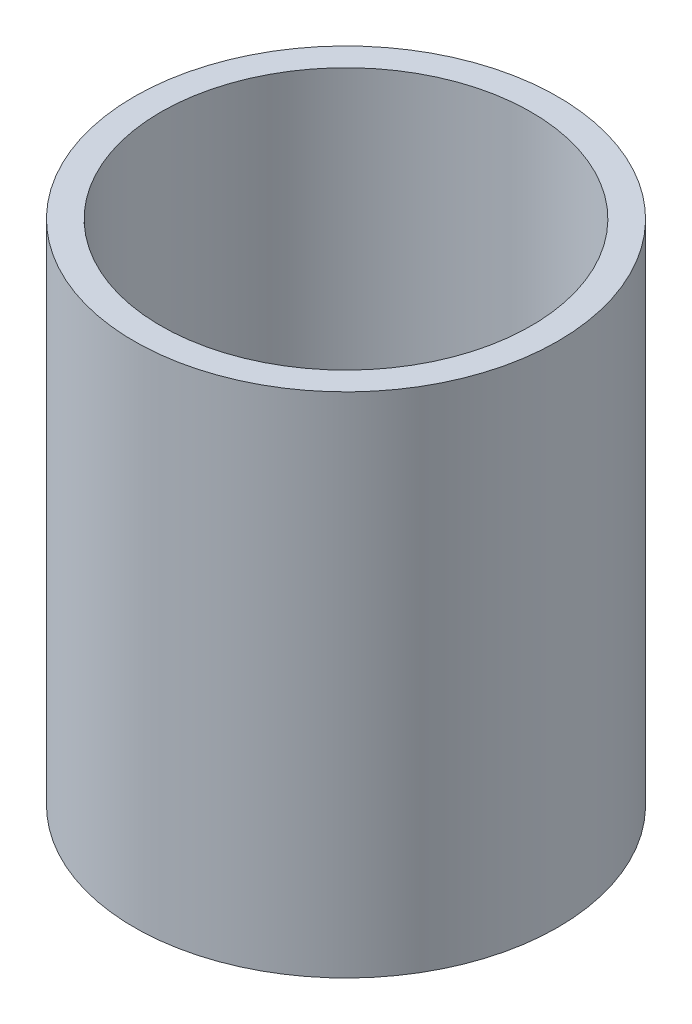
ISO-10303-21;
HEADER;
FILE_DESCRIPTION(('STEP AP214'),'2;1');
FILE_NAME('part.step','',(''),(''),'','','');
FILE_SCHEMA(('AUTOMOTIVE_DESIGN { 1 0 10303 214 1 1 1 1 }'));
ENDSEC;
DATA;
#1=APPLICATION_CONTEXT('core data for automotive mechanical design processes');
#2=APPLICATION_PROTOCOL_DEFINITION('international standard','automotive_design',2000,#1);
#3=PRODUCT_CONTEXT('',#1,'mechanical');
#4=PRODUCT('Part','Part','',(#3));
#5=PRODUCT_RELATED_PRODUCT_CATEGORY('part','',(#4));
#6=PRODUCT_DEFINITION_FORMATION('','',#4);
#7=PRODUCT_DEFINITION_CONTEXT('part definition',#1,'design');
#8=PRODUCT_DEFINITION('design','',#6,#7);
#9=PRODUCT_DEFINITION_SHAPE('','',#8);
#10=(LENGTH_UNIT() NAMED_UNIT(*) SI_UNIT(.MILLI.,.METRE.));
#11=(NAMED_UNIT(*) PLANE_ANGLE_UNIT() SI_UNIT($,.RADIAN.));
#12=(NAMED_UNIT(*) SI_UNIT($,.STERADIAN.) SOLID_ANGLE_UNIT());
#13=UNCERTAINTY_MEASURE_WITH_UNIT(LENGTH_MEASURE(1.E-05),#10,'distance_accuracy_value','');
#14=(GEOMETRIC_REPRESENTATION_CONTEXT(3) GLOBAL_UNCERTAINTY_ASSIGNED_CONTEXT((#13)) GLOBAL_UNIT_ASSIGNED_CONTEXT((#10,
#11,#12)) REPRESENTATION_CONTEXT('',''));
#15=CARTESIAN_POINT('',(0.,0.,0.));
#16=DIRECTION('',(0.,0.,1.));
#17=DIRECTION('',(1.,0.,0.));
#18=AXIS2_PLACEMENT_3D('',#15,#16,#17);
#19=CARTESIAN_POINT('',(0.,-23.1,0.));
#20=DIRECTION('',(0.,1.,0.));
#21=DIRECTION('',(1.,0.,0.));
#22=AXIS2_PLACEMENT_3D('',#19,#20,#21);
#23=PLANE('',#22);
#24=CARTESIAN_POINT('',(5.77301664828964,-23.1,47.9533625008273));
#25=DIRECTION('',(0.,1.,0.));
#26=DIRECTION('',(-1.,0.,0.));
#27=AXIS2_PLACEMENT_3D('',#24,#25,#26);
#28=CIRCLE('',#27,13.9);
#29=CARTESIAN_POINT('',(-8.12698335171036,-23.1,47.9533625008273));
#30=VERTEX_POINT('',#29);
#31=EDGE_CURVE('E23',#30,#30,#28,.T.);
#32=ORIENTED_EDGE('',*,*,#31,.T.);
#33=EDGE_LOOP('',(#32));
#34=FACE_BOUND('',#33,.T.);
#35=CARTESIAN_POINT('',(5.77301664828964,-23.1,47.9533625008273));
#36=DIRECTION('',(0.,1.,0.));
#37=DIRECTION('',(-1.,0.,0.));
#38=AXIS2_PLACEMENT_3D('',#35,#36,#37);
#39=CIRCLE('',#38,15.9);
#40=CARTESIAN_POINT('',(-10.1269833517104,-23.1,47.9533625008273));
#41=VERTEX_POINT('',#40);
#42=EDGE_CURVE('E32',#41,#41,#39,.T.);
#43=ORIENTED_EDGE('',*,*,#42,.F.);
#44=EDGE_LOOP('',(#43));
#45=FACE_BOUND('',#44,.T.);
#46=ADVANCED_FACE('F15',(#34,#45),#23,.F.);
#47=CARTESIAN_POINT('',(0.,15.,0.));
#48=DIRECTION('',(0.,1.,0.));
#49=DIRECTION('',(1.,0.,0.));
#50=AXIS2_PLACEMENT_3D('',#47,#48,#49);
#51=PLANE('',#50);
#52=CARTESIAN_POINT('',(5.77301664828964,15.,47.9533625008273));
#53=DIRECTION('',(0.,1.,0.));
#54=DIRECTION('',(-1.,0.,0.));
#55=AXIS2_PLACEMENT_3D('',#52,#53,#54);
#56=CIRCLE('',#55,13.9);
#57=CARTESIAN_POINT('',(-8.12698335171036,15.,47.9533625008273));
#58=VERTEX_POINT('',#57);
#59=EDGE_CURVE('E10',#58,#58,#56,.T.);
#60=ORIENTED_EDGE('',*,*,#59,.F.);
#61=EDGE_LOOP('',(#60));
#62=FACE_BOUND('',#61,.T.);
#63=CARTESIAN_POINT('',(5.77301664828964,15.,47.9533625008273));
#64=DIRECTION('',(0.,1.,0.));
#65=DIRECTION('',(-1.,0.,0.));
#66=AXIS2_PLACEMENT_3D('',#63,#64,#65);
#67=CIRCLE('',#66,15.9);
#68=CARTESIAN_POINT('',(-10.1269833517104,15.,47.9533625008273));
#69=VERTEX_POINT('',#68);
#70=EDGE_CURVE('E39',#69,#69,#67,.T.);
#71=ORIENTED_EDGE('',*,*,#70,.T.);
#72=EDGE_LOOP('',(#71));
#73=FACE_BOUND('',#72,.T.);
#74=ADVANCED_FACE('F17',(#62,#73),#51,.T.);
#75=CARTESIAN_POINT('',(5.77301664828964,-4.05,47.9533625008273));
#76=DIRECTION('',(0.,1.,0.));
#77=DIRECTION('',(-1.,0.,0.));
#78=AXIS2_PLACEMENT_3D('',#75,#76,#77);
#79=CYLINDRICAL_SURFACE('',#78,13.9);
#80=ORIENTED_EDGE('',*,*,#59,.T.);
#81=EDGE_LOOP('',(#80));
#82=FACE_BOUND('',#81,.T.);
#83=ORIENTED_EDGE('',*,*,#31,.F.);
#84=EDGE_LOOP('',(#83));
#85=FACE_BOUND('',#84,.T.);
#86=ADVANCED_FACE('F51',(#82,#85),#79,.F.);
#87=CARTESIAN_POINT('',(5.77301664828964,-4.05,47.9533625008273));
#88=DIRECTION('',(0.,1.,0.));
#89=DIRECTION('',(-1.,0.,0.));
#90=AXIS2_PLACEMENT_3D('',#87,#88,#89);
#91=CYLINDRICAL_SURFACE('',#90,15.9);
#92=ORIENTED_EDGE('',*,*,#42,.T.);
#93=EDGE_LOOP('',(#92));
#94=FACE_BOUND('',#93,.T.);
#95=ORIENTED_EDGE('',*,*,#70,.F.);
#96=EDGE_LOOP('',(#95));
#97=FACE_BOUND('',#96,.T.);
#98=ADVANCED_FACE('F49',(#94,#97),#91,.T.);
#99=CLOSED_SHELL('',(#46,#74,#86,#98));
#100=MANIFOLD_SOLID_BREP('B1',#99);
#101=ADVANCED_BREP_SHAPE_REPRESENTATION('',(#18,#100),#14);
#102=SHAPE_DEFINITION_REPRESENTATION(#9,#101);
ENDSEC;
END-ISO-10303-21;
